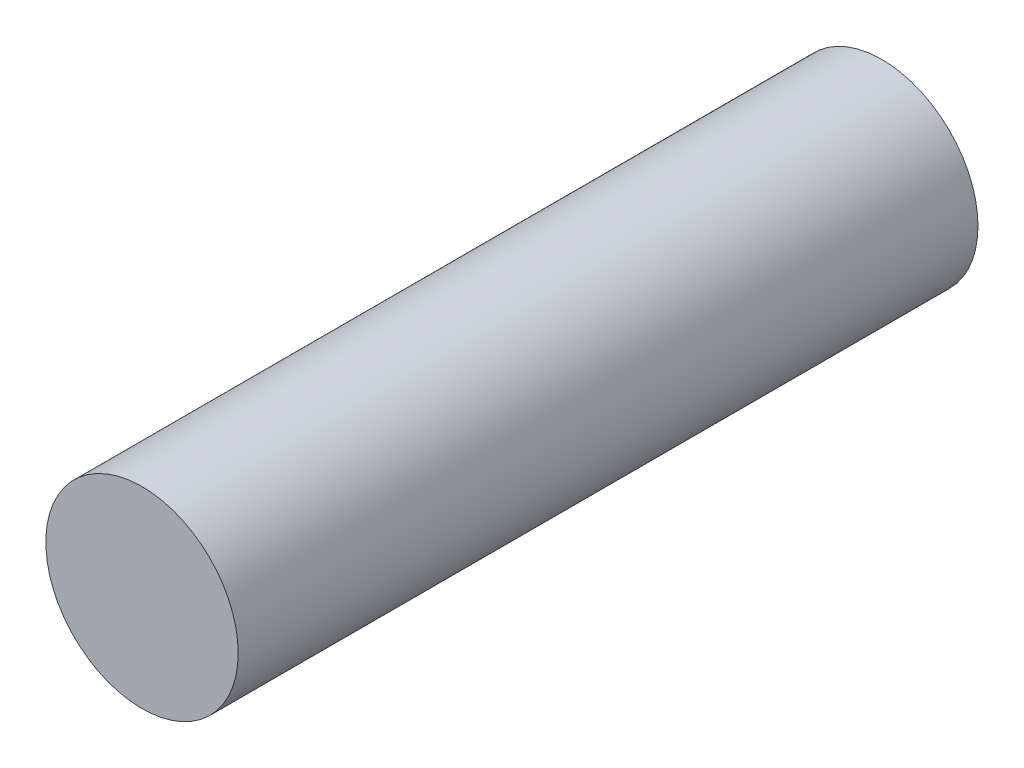
ISO-10303-21;
HEADER;
FILE_DESCRIPTION(('STEP AP214'),'2;1');
FILE_NAME('part.step','',(''),(''),'','','');
FILE_SCHEMA(('AUTOMOTIVE_DESIGN { 1 0 10303 214 1 1 1 1 }'));
ENDSEC;
DATA;
#1=APPLICATION_CONTEXT('core data for automotive mechanical design processes');
#2=APPLICATION_PROTOCOL_DEFINITION('international standard','automotive_design',2000,#1);
#3=PRODUCT_CONTEXT('',#1,'mechanical');
#4=PRODUCT('Part','Part','',(#3));
#5=PRODUCT_RELATED_PRODUCT_CATEGORY('part','',(#4));
#6=PRODUCT_DEFINITION_FORMATION('','',#4);
#7=PRODUCT_DEFINITION_CONTEXT('part definition',#1,'design');
#8=PRODUCT_DEFINITION('design','',#6,#7);
#9=PRODUCT_DEFINITION_SHAPE('','',#8);
#10=(LENGTH_UNIT() NAMED_UNIT(*) SI_UNIT(.MILLI.,.METRE.));
#11=(NAMED_UNIT(*) PLANE_ANGLE_UNIT() SI_UNIT($,.RADIAN.));
#12=(NAMED_UNIT(*) SI_UNIT($,.STERADIAN.) SOLID_ANGLE_UNIT());
#13=UNCERTAINTY_MEASURE_WITH_UNIT(LENGTH_MEASURE(1.E-05),#10,'distance_accuracy_value','');
#14=(GEOMETRIC_REPRESENTATION_CONTEXT(3) GLOBAL_UNCERTAINTY_ASSIGNED_CONTEXT((#13)) GLOBAL_UNIT_ASSIGNED_CONTEXT((#10,
#11,#12)) REPRESENTATION_CONTEXT('',''));
#15=CARTESIAN_POINT('',(0.,0.,0.));
#16=DIRECTION('',(0.,0.,1.));
#17=DIRECTION('',(1.,0.,0.));
#18=AXIS2_PLACEMENT_3D('',#15,#16,#17);
#19=CARTESIAN_POINT('',(0.,0.,100.));
#20=DIRECTION('',(0.,0.,-1.));
#21=DIRECTION('',(-1.,0.,0.));
#22=AXIS2_PLACEMENT_3D('',#19,#20,#21);
#23=CYLINDRICAL_SURFACE('',#22,13.);
#24=CARTESIAN_POINT('',(0.,0.,100.));
#25=DIRECTION('',(0.,0.,1.));
#26=DIRECTION('',(1.,0.,0.));
#27=AXIS2_PLACEMENT_3D('',#24,#25,#26);
#28=CIRCLE('',#27,13.);
#29=CARTESIAN_POINT('',(13.,0.,100.));
#30=VERTEX_POINT('',#29);
#31=EDGE_CURVE('E10',#30,#30,#28,.T.);
#32=ORIENTED_EDGE('',*,*,#31,.F.);
#33=EDGE_LOOP('',(#32));
#34=FACE_BOUND('',#33,.T.);
#35=CARTESIAN_POINT('',(0.,0.,0.));
#36=DIRECTION('',(0.,0.,1.));
#37=DIRECTION('',(1.,0.,0.));
#38=AXIS2_PLACEMENT_3D('',#35,#36,#37);
#39=CIRCLE('',#38,13.);
#40=CARTESIAN_POINT('',(13.,0.,0.));
#41=VERTEX_POINT('',#40);
#42=EDGE_CURVE('E34',#41,#41,#39,.T.);
#43=ORIENTED_EDGE('',*,*,#42,.T.);
#44=EDGE_LOOP('',(#43));
#45=FACE_BOUND('',#44,.T.);
#46=ADVANCED_FACE('F31',(#34,#45),#23,.T.);
#47=CARTESIAN_POINT('',(0.,0.,100.));
#48=DIRECTION('',(0.,0.,1.));
#49=DIRECTION('',(1.,0.,0.));
#50=AXIS2_PLACEMENT_3D('',#47,#48,#49);
#51=PLANE('',#50);
#52=ORIENTED_EDGE('',*,*,#31,.T.);
#53=EDGE_LOOP('',(#52));
#54=FACE_BOUND('',#53,.T.);
#55=ADVANCED_FACE('F46',(#54),#51,.T.);
#56=CARTESIAN_POINT('',(0.,0.,0.));
#57=DIRECTION('',(0.,0.,1.));
#58=DIRECTION('',(1.,0.,0.));
#59=AXIS2_PLACEMENT_3D('',#56,#57,#58);
#60=PLANE('',#59);
#61=ORIENTED_EDGE('',*,*,#42,.F.);
#62=EDGE_LOOP('',(#61));
#63=FACE_BOUND('',#62,.T.);
#64=ADVANCED_FACE('F44',(#63),#60,.F.);
#65=CLOSED_SHELL('',(#46,#55,#64));
#66=MANIFOLD_SOLID_BREP('B2',#65);
#67=ADVANCED_BREP_SHAPE_REPRESENTATION('',(#18,#66),#14);
#68=SHAPE_DEFINITION_REPRESENTATION(#9,#67);
ENDSEC;
END-ISO-10303-21;
